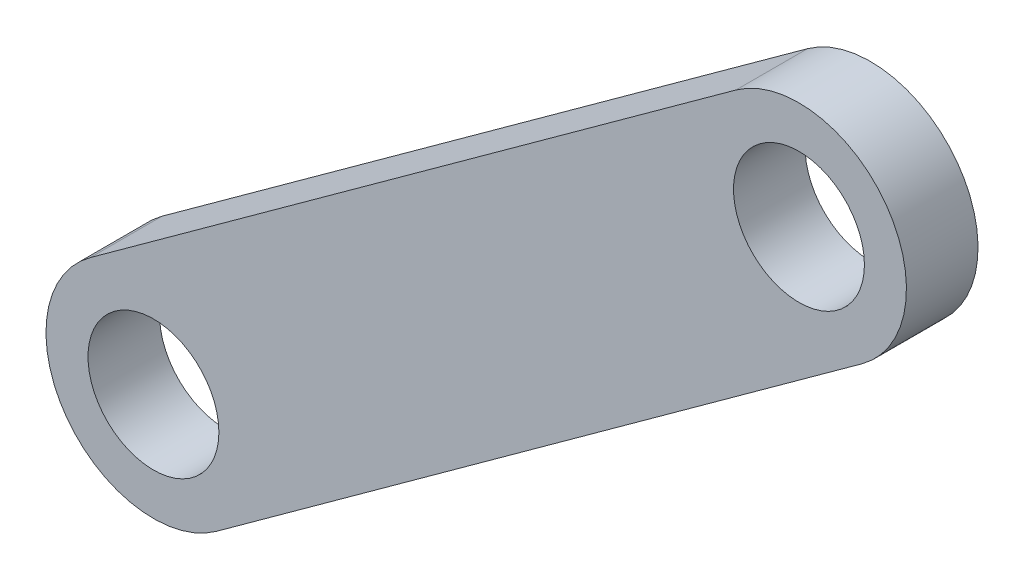
ISO-10303-21;
HEADER;
FILE_DESCRIPTION(('STEP AP214'),'2;1');
FILE_NAME('part.step','',(''),(''),'','','');
FILE_SCHEMA(('AUTOMOTIVE_DESIGN { 1 0 10303 214 1 1 1 1 }'));
ENDSEC;
DATA;
#1=APPLICATION_CONTEXT('core data for automotive mechanical design processes');
#2=APPLICATION_PROTOCOL_DEFINITION('international standard','automotive_design',2000,#1);
#3=PRODUCT_CONTEXT('',#1,'mechanical');
#4=PRODUCT('Part','Part','',(#3));
#5=PRODUCT_RELATED_PRODUCT_CATEGORY('part','',(#4));
#6=PRODUCT_DEFINITION_FORMATION('','',#4);
#7=PRODUCT_DEFINITION_CONTEXT('part definition',#1,'design');
#8=PRODUCT_DEFINITION('design','',#6,#7);
#9=PRODUCT_DEFINITION_SHAPE('','',#8);
#10=(LENGTH_UNIT() NAMED_UNIT(*) SI_UNIT(.MILLI.,.METRE.));
#11=(NAMED_UNIT(*) PLANE_ANGLE_UNIT() SI_UNIT($,.RADIAN.));
#12=(NAMED_UNIT(*) SI_UNIT($,.STERADIAN.) SOLID_ANGLE_UNIT());
#13=UNCERTAINTY_MEASURE_WITH_UNIT(LENGTH_MEASURE(1.E-05),#10,'distance_accuracy_value','');
#14=(GEOMETRIC_REPRESENTATION_CONTEXT(3) GLOBAL_UNCERTAINTY_ASSIGNED_CONTEXT((#13)) GLOBAL_UNIT_ASSIGNED_CONTEXT((#10,
#11,#12)) REPRESENTATION_CONTEXT('',''));
#15=CARTESIAN_POINT('',(0.,0.,0.));
#16=DIRECTION('',(0.,0.,1.));
#17=DIRECTION('',(1.,0.,0.));
#18=AXIS2_PLACEMENT_3D('',#15,#16,#17);
#19=CARTESIAN_POINT('',(6.51438585400758,5.44795593656477,2.));
#20=DIRECTION('',(0.,0.,1.));
#21=DIRECTION('',(1.,0.,0.));
#22=AXIS2_PLACEMENT_3D('',#19,#20,#21);
#23=PLANE('',#22);
#24=CARTESIAN_POINT('',(6.51438585400758,5.44795593656477,2.));
#25=DIRECTION('',(0.,0.,1.));
#26=DIRECTION('',(1.,0.,0.));
#27=AXIS2_PLACEMENT_3D('',#24,#25,#26);
#28=CIRCLE('',#27,3.65717236060589);
#29=CARTESIAN_POINT('',(10.1715582146135,5.44795593656477,2.));
#30=VERTEX_POINT('',#29);
#31=EDGE_CURVE('E92',#30,#30,#28,.T.);
#32=ORIENTED_EDGE('',*,*,#31,.F.);
#33=EDGE_LOOP('',(#32));
#34=FACE_BOUND('',#33,.T.);
#35=CARTESIAN_POINT('',(6.51438585400758,5.44795593656477,2.));
#36=DIRECTION('',(0.,0.,1.));
#37=DIRECTION('',(1.,0.,0.));
#38=AXIS2_PLACEMENT_3D('',#35,#36,#37);
#39=CIRCLE('',#38,6.00489162856606);
#40=CARTESIAN_POINT('',(2.99047269433571,10.3101323539641,2.));
#41=VERTEX_POINT('',#40);
#42=CARTESIAN_POINT('',(10.0382990136794,0.585779519165427,2.));
#43=VERTEX_POINT('',#42);
#44=EDGE_CURVE('E103',#41,#43,#39,.T.);
#45=ORIENTED_EDGE('',*,*,#44,.T.);
#46=DIRECTION('',(0.809702608831327,0.58684042571362,0.));
#47=VECTOR('',#46,1.);
#48=CARTESIAN_POINT('',(46.10819261667,26.7278117746567,2.));
#49=LINE('',#48,#47);
#50=CARTESIAN_POINT('',(46.10819261667,26.7278117746566,2.));
#51=VERTEX_POINT('',#50);
#52=EDGE_CURVE('E87',#43,#51,#49,.T.);
#53=ORIENTED_EDGE('',*,*,#52,.T.);
#54=CARTESIAN_POINT('',(42.5842794569981,31.589988192056,2.));
#55=DIRECTION('',(0.,0.,1.));
#56=DIRECTION('',(1.,0.,0.));
#57=AXIS2_PLACEMENT_3D('',#54,#55,#56);
#58=CIRCLE('',#57,6.00489162856608);
#59=CARTESIAN_POINT('',(39.0603662973262,36.4521646094554,2.));
#60=VERTEX_POINT('',#59);
#61=EDGE_CURVE('E53',#51,#60,#58,.T.);
#62=ORIENTED_EDGE('',*,*,#61,.T.);
#63=DIRECTION('',(-0.809702608831327,-0.586840425713621,0.));
#64=VECTOR('',#63,1.);
#65=CARTESIAN_POINT('',(2.99047269433571,10.3101323539641,2.));
#66=LINE('',#65,#64);
#67=EDGE_CURVE('E48',#60,#41,#66,.T.);
#68=ORIENTED_EDGE('',*,*,#67,.T.);
#69=EDGE_LOOP('',(#45,#53,#62,#68));
#70=FACE_BOUND('',#69,.T.);
#71=CARTESIAN_POINT('',(42.5842794569981,31.589988192056,2.));
#72=DIRECTION('',(0.,0.,1.));
#73=DIRECTION('',(1.,0.,0.));
#74=AXIS2_PLACEMENT_3D('',#71,#72,#73);
#75=CIRCLE('',#74,3.65717236060589);
#76=CARTESIAN_POINT('',(46.241451817604,31.589988192056,2.));
#77=VERTEX_POINT('',#76);
#78=EDGE_CURVE('E125',#77,#77,#75,.T.);
#79=ORIENTED_EDGE('',*,*,#78,.F.);
#80=EDGE_LOOP('',(#79));
#81=FACE_BOUND('',#80,.T.);
#82=ADVANCED_FACE('F33',(#34,#70,#81),#23,.T.);
#83=CARTESIAN_POINT('',(6.51438585400758,5.44795593656477,-2.));
#84=DIRECTION('',(0.,0.,1.));
#85=DIRECTION('',(1.,0.,0.));
#86=AXIS2_PLACEMENT_3D('',#83,#84,#85);
#87=PLANE('',#86);
#88=CARTESIAN_POINT('',(6.51438585400758,5.44795593656477,-2.));
#89=DIRECTION('',(0.,0.,1.));
#90=DIRECTION('',(1.,0.,0.));
#91=AXIS2_PLACEMENT_3D('',#88,#89,#90);
#92=CIRCLE('',#91,3.65717236060589);
#93=CARTESIAN_POINT('',(10.1715582146135,5.44795593656477,-2.));
#94=VERTEX_POINT('',#93);
#95=EDGE_CURVE('E96',#94,#94,#92,.T.);
#96=ORIENTED_EDGE('',*,*,#95,.T.);
#97=EDGE_LOOP('',(#96));
#98=FACE_BOUND('',#97,.T.);
#99=CARTESIAN_POINT('',(6.51438585400758,5.44795593656477,-2.));
#100=DIRECTION('',(0.,0.,1.));
#101=DIRECTION('',(1.,0.,0.));
#102=AXIS2_PLACEMENT_3D('',#99,#100,#101);
#103=CIRCLE('',#102,6.00489162856606);
#104=CARTESIAN_POINT('',(2.99047269433571,10.3101323539641,-2.));
#105=VERTEX_POINT('',#104);
#106=CARTESIAN_POINT('',(10.0382990136794,0.585779519165427,-2.));
#107=VERTEX_POINT('',#106);
#108=EDGE_CURVE('E79',#105,#107,#103,.T.);
#109=ORIENTED_EDGE('',*,*,#108,.F.);
#110=DIRECTION('',(-0.809702608831327,-0.586840425713621,0.));
#111=VECTOR('',#110,1.);
#112=CARTESIAN_POINT('',(2.99047269433571,10.3101323539641,-2.));
#113=LINE('',#112,#111);
#114=CARTESIAN_POINT('',(39.0603662973262,36.4521646094554,-2.));
#115=VERTEX_POINT('',#114);
#116=EDGE_CURVE('E101',#115,#105,#113,.T.);
#117=ORIENTED_EDGE('',*,*,#116,.F.);
#118=CARTESIAN_POINT('',(42.5842794569981,31.589988192056,-2.));
#119=DIRECTION('',(0.,0.,1.));
#120=DIRECTION('',(1.,0.,0.));
#121=AXIS2_PLACEMENT_3D('',#118,#119,#120);
#122=CIRCLE('',#121,6.00489162856608);
#123=CARTESIAN_POINT('',(46.10819261667,26.7278117746566,-2.));
#124=VERTEX_POINT('',#123);
#125=EDGE_CURVE('E80',#124,#115,#122,.T.);
#126=ORIENTED_EDGE('',*,*,#125,.F.);
#127=DIRECTION('',(0.809702608831327,0.58684042571362,0.));
#128=VECTOR('',#127,1.);
#129=CARTESIAN_POINT('',(46.10819261667,26.7278117746567,-2.));
#130=LINE('',#129,#128);
#131=EDGE_CURVE('E74',#107,#124,#130,.T.);
#132=ORIENTED_EDGE('',*,*,#131,.F.);
#133=EDGE_LOOP('',(#109,#117,#126,#132));
#134=FACE_BOUND('',#133,.T.);
#135=CARTESIAN_POINT('',(42.5842794569981,31.589988192056,-2.));
#136=DIRECTION('',(0.,0.,1.));
#137=DIRECTION('',(1.,0.,0.));
#138=AXIS2_PLACEMENT_3D('',#135,#136,#137);
#139=CIRCLE('',#138,3.65717236060589);
#140=CARTESIAN_POINT('',(46.241451817604,31.589988192056,-2.));
#141=VERTEX_POINT('',#140);
#142=EDGE_CURVE('E128',#141,#141,#139,.T.);
#143=ORIENTED_EDGE('',*,*,#142,.T.);
#144=EDGE_LOOP('',(#143));
#145=FACE_BOUND('',#144,.T.);
#146=ADVANCED_FACE('F75',(#98,#134,#145),#87,.F.);
#147=CARTESIAN_POINT('',(6.51438585400758,5.44795593656477,2.));
#148=DIRECTION('',(0.,0.,-1.));
#149=DIRECTION('',(-1.,0.,0.));
#150=AXIS2_PLACEMENT_3D('',#147,#148,#149);
#151=CYLINDRICAL_SURFACE('',#150,6.00489162856606);
#152=ORIENTED_EDGE('',*,*,#108,.T.);
#153=DIRECTION('',(0.,0.,-1.));
#154=VECTOR('',#153,1.);
#155=CARTESIAN_POINT('',(10.0382990136794,0.585779519165427,2.));
#156=LINE('',#155,#154);
#157=EDGE_CURVE('E11',#43,#107,#156,.T.);
#158=ORIENTED_EDGE('',*,*,#157,.F.);
#159=ORIENTED_EDGE('',*,*,#44,.F.);
#160=DIRECTION('',(0.,0.,-1.));
#161=VECTOR('',#160,1.);
#162=CARTESIAN_POINT('',(2.99047269433571,10.3101323539641,2.));
#163=LINE('',#162,#161);
#164=EDGE_CURVE('E91',#41,#105,#163,.T.);
#165=ORIENTED_EDGE('',*,*,#164,.T.);
#166=EDGE_LOOP('',(#152,#158,#159,#165));
#167=FACE_BOUND('',#166,.T.);
#168=ADVANCED_FACE('F35',(#167),#151,.T.);
#169=CARTESIAN_POINT('',(46.10819261667,26.7278117746567,2.));
#170=DIRECTION('',(-0.58684042571362,0.809702608831327,0.));
#171=DIRECTION('',(-0.809702608831327,-0.58684042571362,0.));
#172=AXIS2_PLACEMENT_3D('',#169,#170,#171);
#173=PLANE('',#172);
#174=ORIENTED_EDGE('',*,*,#131,.T.);
#175=DIRECTION('',(0.,0.,-1.));
#176=VECTOR('',#175,1.);
#177=CARTESIAN_POINT('',(46.10819261667,26.7278117746566,2.));
#178=LINE('',#177,#176);
#179=EDGE_CURVE('E41',#51,#124,#178,.T.);
#180=ORIENTED_EDGE('',*,*,#179,.F.);
#181=ORIENTED_EDGE('',*,*,#52,.F.);
#182=ORIENTED_EDGE('',*,*,#157,.T.);
#183=EDGE_LOOP('',(#174,#180,#181,#182));
#184=FACE_BOUND('',#183,.T.);
#185=ADVANCED_FACE('F86',(#184),#173,.F.);
#186=CARTESIAN_POINT('',(42.5842794569981,31.589988192056,2.));
#187=DIRECTION('',(0.,0.,-1.));
#188=DIRECTION('',(-1.,0.,0.));
#189=AXIS2_PLACEMENT_3D('',#186,#187,#188);
#190=CYLINDRICAL_SURFACE('',#189,6.00489162856608);
#191=ORIENTED_EDGE('',*,*,#125,.T.);
#192=DIRECTION('',(0.,0.,-1.));
#193=VECTOR('',#192,1.);
#194=CARTESIAN_POINT('',(39.0603662973262,36.4521646094554,2.));
#195=LINE('',#194,#193);
#196=EDGE_CURVE('E111',#60,#115,#195,.T.);
#197=ORIENTED_EDGE('',*,*,#196,.F.);
#198=ORIENTED_EDGE('',*,*,#61,.F.);
#199=ORIENTED_EDGE('',*,*,#179,.T.);
#200=EDGE_LOOP('',(#191,#197,#198,#199));
#201=FACE_BOUND('',#200,.T.);
#202=ADVANCED_FACE('F116',(#201),#190,.T.);
#203=CARTESIAN_POINT('',(2.99047269433571,10.3101323539641,2.));
#204=DIRECTION('',(0.586840425713621,-0.809702608831327,0.));
#205=DIRECTION('',(0.809702608831327,0.586840425713621,0.));
#206=AXIS2_PLACEMENT_3D('',#203,#204,#205);
#207=PLANE('',#206);
#208=ORIENTED_EDGE('',*,*,#116,.T.);
#209=ORIENTED_EDGE('',*,*,#164,.F.);
#210=ORIENTED_EDGE('',*,*,#67,.F.);
#211=ORIENTED_EDGE('',*,*,#196,.T.);
#212=EDGE_LOOP('',(#208,#209,#210,#211));
#213=FACE_BOUND('',#212,.T.);
#214=ADVANCED_FACE('F118',(#213),#207,.F.);
#215=CARTESIAN_POINT('',(6.51438585400758,5.44795593656477,2.));
#216=DIRECTION('',(0.,0.,-1.));
#217=DIRECTION('',(-1.,0.,0.));
#218=AXIS2_PLACEMENT_3D('',#215,#216,#217);
#219=CYLINDRICAL_SURFACE('',#218,3.65717236060589);
#220=ORIENTED_EDGE('',*,*,#31,.T.);
#221=EDGE_LOOP('',(#220));
#222=FACE_BOUND('',#221,.T.);
#223=ORIENTED_EDGE('',*,*,#95,.F.);
#224=EDGE_LOOP('',(#223));
#225=FACE_BOUND('',#224,.T.);
#226=ADVANCED_FACE('F141',(#222,#225),#219,.F.);
#227=CARTESIAN_POINT('',(42.5842794569981,31.589988192056,2.));
#228=DIRECTION('',(0.,0.,-1.));
#229=DIRECTION('',(-1.,0.,0.));
#230=AXIS2_PLACEMENT_3D('',#227,#228,#229);
#231=CYLINDRICAL_SURFACE('',#230,3.65717236060589);
#232=ORIENTED_EDGE('',*,*,#78,.T.);
#233=EDGE_LOOP('',(#232));
#234=FACE_BOUND('',#233,.T.);
#235=ORIENTED_EDGE('',*,*,#142,.F.);
#236=EDGE_LOOP('',(#235));
#237=FACE_BOUND('',#236,.T.);
#238=ADVANCED_FACE('F139',(#234,#237),#231,.F.);
#239=CLOSED_SHELL('',(#82,#146,#168,#185,#202,#214,#226,#238));
#240=MANIFOLD_SOLID_BREP('B2',#239);
#241=ADVANCED_BREP_SHAPE_REPRESENTATION('',(#18,#240),#14);
#242=SHAPE_DEFINITION_REPRESENTATION(#9,#241);
ENDSEC;
END-ISO-10303-21;
